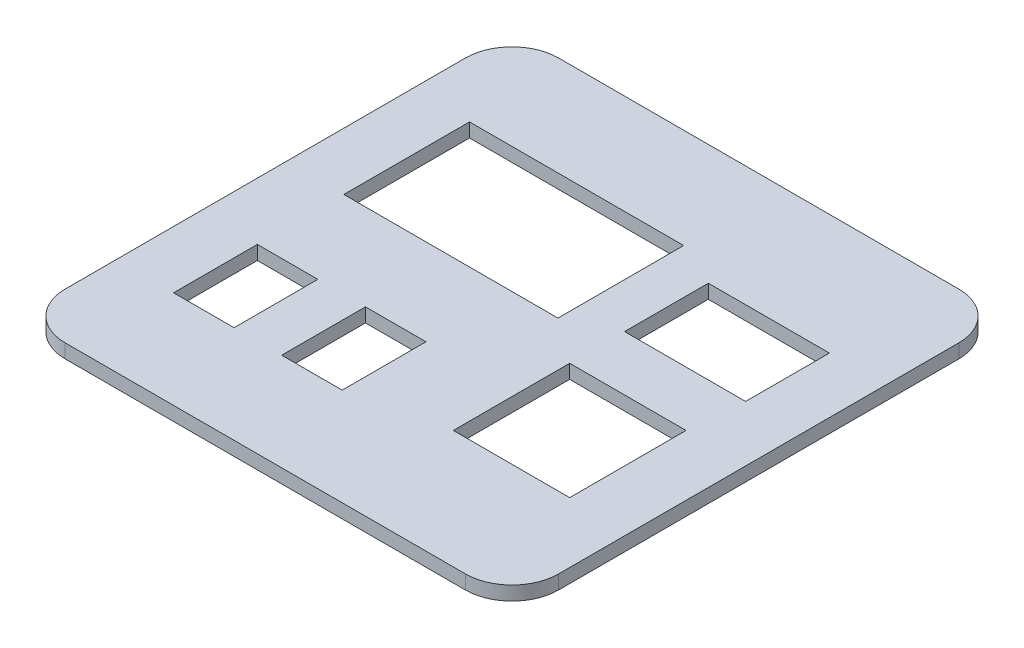
ISO-10303-21;
HEADER;
FILE_DESCRIPTION(('STEP AP214'),'2;1');
FILE_NAME('part.step','',(''),(''),'','','');
FILE_SCHEMA(('AUTOMOTIVE_DESIGN { 1 0 10303 214 1 1 1 1 }'));
ENDSEC;
DATA;
#1=APPLICATION_CONTEXT('core data for automotive mechanical design processes');
#2=APPLICATION_PROTOCOL_DEFINITION('international standard','automotive_design',2000,#1);
#3=PRODUCT_CONTEXT('',#1,'mechanical');
#4=PRODUCT('Part','Part','',(#3));
#5=PRODUCT_RELATED_PRODUCT_CATEGORY('part','',(#4));
#6=PRODUCT_DEFINITION_FORMATION('','',#4);
#7=PRODUCT_DEFINITION_CONTEXT('part definition',#1,'design');
#8=PRODUCT_DEFINITION('design','',#6,#7);
#9=PRODUCT_DEFINITION_SHAPE('','',#8);
#10=(LENGTH_UNIT() NAMED_UNIT(*) SI_UNIT(.MILLI.,.METRE.));
#11=(NAMED_UNIT(*) PLANE_ANGLE_UNIT() SI_UNIT($,.RADIAN.));
#12=(NAMED_UNIT(*) SI_UNIT($,.STERADIAN.) SOLID_ANGLE_UNIT());
#13=UNCERTAINTY_MEASURE_WITH_UNIT(LENGTH_MEASURE(1.E-05),#10,'distance_accuracy_value','');
#14=(GEOMETRIC_REPRESENTATION_CONTEXT(3) GLOBAL_UNCERTAINTY_ASSIGNED_CONTEXT((#13)) GLOBAL_UNIT_ASSIGNED_CONTEXT((#10,
#11,#12)) REPRESENTATION_CONTEXT('',''));
#15=CARTESIAN_POINT('',(0.,0.,0.));
#16=DIRECTION('',(0.,0.,1.));
#17=DIRECTION('',(1.,0.,0.));
#18=AXIS2_PLACEMENT_3D('',#15,#16,#17);
#19=CARTESIAN_POINT('',(43.,3.,-43.));
#20=DIRECTION('',(0.,-1.,0.));
#21=DIRECTION('',(0.,0.,-1.));
#22=AXIS2_PLACEMENT_3D('',#19,#20,#21);
#23=CYLINDRICAL_SURFACE('',#22,10.);
#24=CARTESIAN_POINT('',(43.,0.,-43.));
#25=DIRECTION('',(0.,1.,0.));
#26=DIRECTION('',(0.,0.,1.));
#27=AXIS2_PLACEMENT_3D('',#24,#25,#26);
#28=CIRCLE('',#27,10.);
#29=CARTESIAN_POINT('',(42.9999999999999,0.,-53.));
#30=VERTEX_POINT('',#29);
#31=CARTESIAN_POINT('',(53.,0.,-42.9999999999999));
#32=VERTEX_POINT('',#31);
#33=EDGE_CURVE('E431',#30,#32,#28,.F.);
#34=ORIENTED_EDGE('',*,*,#33,.F.);
#35=DIRECTION('',(0.,-1.,0.));
#36=VECTOR('',#35,1.);
#37=CARTESIAN_POINT('',(42.9999999999999,3.,-53.));
#38=LINE('',#37,#36);
#39=CARTESIAN_POINT('',(42.9999999999999,3.,-53.));
#40=VERTEX_POINT('',#39);
#41=EDGE_CURVE('E11',#40,#30,#38,.T.);
#42=ORIENTED_EDGE('',*,*,#41,.F.);
#43=CARTESIAN_POINT('',(43.,3.,-43.));
#44=DIRECTION('',(0.,1.,0.));
#45=DIRECTION('',(0.,0.,1.));
#46=AXIS2_PLACEMENT_3D('',#43,#44,#45);
#47=CIRCLE('',#46,10.);
#48=CARTESIAN_POINT('',(53.,3.,-42.9999999999999));
#49=VERTEX_POINT('',#48);
#50=EDGE_CURVE('E525',#40,#49,#47,.F.);
#51=ORIENTED_EDGE('',*,*,#50,.T.);
#52=DIRECTION('',(0.,-1.,0.));
#53=VECTOR('',#52,1.);
#54=CARTESIAN_POINT('',(53.,3.,-42.9999999999999));
#55=LINE('',#54,#53);
#56=EDGE_CURVE('E153',#49,#32,#55,.T.);
#57=ORIENTED_EDGE('',*,*,#56,.T.);
#58=EDGE_LOOP('',(#34,#42,#51,#57));
#59=FACE_BOUND('',#58,.T.);
#60=ADVANCED_FACE('F39',(#59),#23,.T.);
#61=CARTESIAN_POINT('',(0.,3.,-53.));
#62=DIRECTION('',(0.,0.,-1.));
#63=DIRECTION('',(-1.,0.,0.));
#64=AXIS2_PLACEMENT_3D('',#61,#62,#63);
#65=PLANE('',#64);
#66=DIRECTION('',(1.,0.,0.));
#67=VECTOR('',#66,1.);
#68=CARTESIAN_POINT('',(0.,0.,-53.));
#69=LINE('',#68,#67);
#70=CARTESIAN_POINT('',(-42.9999999999999,0.,-53.));
#71=VERTEX_POINT('',#70);
#72=EDGE_CURVE('E434',#71,#30,#69,.T.);
#73=ORIENTED_EDGE('',*,*,#72,.F.);
#74=DIRECTION('',(0.,-1.,0.));
#75=VECTOR('',#74,1.);
#76=CARTESIAN_POINT('',(-42.9999999999999,3.,-53.));
#77=LINE('',#76,#75);
#78=CARTESIAN_POINT('',(-42.9999999999999,3.,-53.));
#79=VERTEX_POINT('',#78);
#80=EDGE_CURVE('E50',#79,#71,#77,.T.);
#81=ORIENTED_EDGE('',*,*,#80,.F.);
#82=DIRECTION('',(1.,0.,0.));
#83=VECTOR('',#82,1.);
#84=CARTESIAN_POINT('',(0.,3.,-53.));
#85=LINE('',#84,#83);
#86=EDGE_CURVE('E528',#79,#40,#85,.T.);
#87=ORIENTED_EDGE('',*,*,#86,.T.);
#88=ORIENTED_EDGE('',*,*,#41,.T.);
#89=EDGE_LOOP('',(#73,#81,#87,#88));
#90=FACE_BOUND('',#89,.T.);
#91=ADVANCED_FACE('F555',(#90),#65,.T.);
#92=CARTESIAN_POINT('',(-43.,3.,-43.));
#93=DIRECTION('',(0.,-1.,0.));
#94=DIRECTION('',(0.,0.,-1.));
#95=AXIS2_PLACEMENT_3D('',#92,#93,#94);
#96=CYLINDRICAL_SURFACE('',#95,10.);
#97=CARTESIAN_POINT('',(-43.,0.,-43.));
#98=DIRECTION('',(0.,1.,0.));
#99=DIRECTION('',(0.,0.,1.));
#100=AXIS2_PLACEMENT_3D('',#97,#98,#99);
#101=CIRCLE('',#100,10.);
#102=CARTESIAN_POINT('',(-53.,0.,-42.9999999999999));
#103=VERTEX_POINT('',#102);
#104=EDGE_CURVE('E438',#103,#71,#101,.F.);
#105=ORIENTED_EDGE('',*,*,#104,.F.);
#106=DIRECTION('',(0.,-1.,0.));
#107=VECTOR('',#106,1.);
#108=CARTESIAN_POINT('',(-53.,3.,-42.9999999999999));
#109=LINE('',#108,#107);
#110=CARTESIAN_POINT('',(-53.,3.,-42.9999999999999));
#111=VERTEX_POINT('',#110);
#112=EDGE_CURVE('E271',#111,#103,#109,.T.);
#113=ORIENTED_EDGE('',*,*,#112,.F.);
#114=CARTESIAN_POINT('',(-43.,3.,-43.));
#115=DIRECTION('',(0.,1.,0.));
#116=DIRECTION('',(0.,0.,1.));
#117=AXIS2_PLACEMENT_3D('',#114,#115,#116);
#118=CIRCLE('',#117,10.);
#119=EDGE_CURVE('E532',#111,#79,#118,.F.);
#120=ORIENTED_EDGE('',*,*,#119,.T.);
#121=ORIENTED_EDGE('',*,*,#80,.T.);
#122=EDGE_LOOP('',(#105,#113,#120,#121));
#123=FACE_BOUND('',#122,.T.);
#124=ADVANCED_FACE('F551',(#123),#96,.T.);
#125=CARTESIAN_POINT('',(-53.,3.,0.));
#126=DIRECTION('',(-1.,0.,0.));
#127=DIRECTION('',(0.,0.,1.));
#128=AXIS2_PLACEMENT_3D('',#125,#126,#127);
#129=PLANE('',#128);
#130=DIRECTION('',(0.,0.,-1.));
#131=VECTOR('',#130,1.);
#132=CARTESIAN_POINT('',(-53.,0.,0.));
#133=LINE('',#132,#131);
#134=CARTESIAN_POINT('',(-53.,0.,42.9999999999999));
#135=VERTEX_POINT('',#134);
#136=EDGE_CURVE('E442',#135,#103,#133,.T.);
#137=ORIENTED_EDGE('',*,*,#136,.F.);
#138=DIRECTION('',(0.,-1.,0.));
#139=VECTOR('',#138,1.);
#140=CARTESIAN_POINT('',(-53.,3.,42.9999999999999));
#141=LINE('',#140,#139);
#142=CARTESIAN_POINT('',(-53.,3.,42.9999999999999));
#143=VERTEX_POINT('',#142);
#144=EDGE_CURVE('E264',#143,#135,#141,.T.);
#145=ORIENTED_EDGE('',*,*,#144,.F.);
#146=DIRECTION('',(0.,0.,-1.));
#147=VECTOR('',#146,1.);
#148=CARTESIAN_POINT('',(-53.,3.,0.));
#149=LINE('',#148,#147);
#150=EDGE_CURVE('E536',#143,#111,#149,.T.);
#151=ORIENTED_EDGE('',*,*,#150,.T.);
#152=ORIENTED_EDGE('',*,*,#112,.T.);
#153=EDGE_LOOP('',(#137,#145,#151,#152));
#154=FACE_BOUND('',#153,.T.);
#155=ADVANCED_FACE('F548',(#154),#129,.T.);
#156=CARTESIAN_POINT('',(-43.,3.,43.));
#157=DIRECTION('',(0.,-1.,0.));
#158=DIRECTION('',(0.,0.,-1.));
#159=AXIS2_PLACEMENT_3D('',#156,#157,#158);
#160=CYLINDRICAL_SURFACE('',#159,10.);
#161=CARTESIAN_POINT('',(-43.,0.,43.));
#162=DIRECTION('',(0.,1.,0.));
#163=DIRECTION('',(0.,0.,1.));
#164=AXIS2_PLACEMENT_3D('',#161,#162,#163);
#165=CIRCLE('',#164,10.);
#166=CARTESIAN_POINT('',(-42.9999999999999,0.,53.));
#167=VERTEX_POINT('',#166);
#168=EDGE_CURVE('E446',#167,#135,#165,.F.);
#169=ORIENTED_EDGE('',*,*,#168,.F.);
#170=DIRECTION('',(0.,-1.,0.));
#171=VECTOR('',#170,1.);
#172=CARTESIAN_POINT('',(-42.9999999999999,3.,53.));
#173=LINE('',#172,#171);
#174=CARTESIAN_POINT('',(-42.9999999999999,3.,53.));
#175=VERTEX_POINT('',#174);
#176=EDGE_CURVE('E260',#175,#167,#173,.T.);
#177=ORIENTED_EDGE('',*,*,#176,.F.);
#178=CARTESIAN_POINT('',(-43.,3.,43.));
#179=DIRECTION('',(0.,1.,0.));
#180=DIRECTION('',(0.,0.,1.));
#181=AXIS2_PLACEMENT_3D('',#178,#179,#180);
#182=CIRCLE('',#181,10.);
#183=EDGE_CURVE('E252',#175,#143,#182,.F.);
#184=ORIENTED_EDGE('',*,*,#183,.T.);
#185=ORIENTED_EDGE('',*,*,#144,.T.);
#186=EDGE_LOOP('',(#169,#177,#184,#185));
#187=FACE_BOUND('',#186,.T.);
#188=ADVANCED_FACE('F544',(#187),#160,.T.);
#189=CARTESIAN_POINT('',(0.,3.,53.));
#190=DIRECTION('',(0.,0.,-1.));
#191=DIRECTION('',(-1.,0.,0.));
#192=AXIS2_PLACEMENT_3D('',#189,#190,#191);
#193=PLANE('',#192);
#194=DIRECTION('',(1.,0.,0.));
#195=VECTOR('',#194,1.);
#196=CARTESIAN_POINT('',(0.,0.,53.));
#197=LINE('',#196,#195);
#198=CARTESIAN_POINT('',(42.9999999999999,0.,53.));
#199=VERTEX_POINT('',#198);
#200=EDGE_CURVE('E258',#167,#199,#197,.T.);
#201=ORIENTED_EDGE('',*,*,#200,.T.);
#202=DIRECTION('',(0.,-1.,0.));
#203=VECTOR('',#202,1.);
#204=CARTESIAN_POINT('',(42.9999999999999,3.,53.));
#205=LINE('',#204,#203);
#206=CARTESIAN_POINT('',(42.9999999999999,3.,53.));
#207=VERTEX_POINT('',#206);
#208=EDGE_CURVE('E241',#207,#199,#205,.T.);
#209=ORIENTED_EDGE('',*,*,#208,.F.);
#210=DIRECTION('',(1.,0.,0.));
#211=VECTOR('',#210,1.);
#212=CARTESIAN_POINT('',(0.,3.,53.));
#213=LINE('',#212,#211);
#214=EDGE_CURVE('E245',#175,#207,#213,.T.);
#215=ORIENTED_EDGE('',*,*,#214,.F.);
#216=ORIENTED_EDGE('',*,*,#176,.T.);
#217=EDGE_LOOP('',(#201,#209,#215,#216));
#218=FACE_BOUND('',#217,.T.);
#219=ADVANCED_FACE('F256',(#218),#193,.F.);
#220=CARTESIAN_POINT('',(43.,3.,43.));
#221=DIRECTION('',(0.,-1.,0.));
#222=DIRECTION('',(0.,0.,-1.));
#223=AXIS2_PLACEMENT_3D('',#220,#221,#222);
#224=CYLINDRICAL_SURFACE('',#223,10.);
#225=CARTESIAN_POINT('',(43.,0.,43.));
#226=DIRECTION('',(0.,1.,0.));
#227=DIRECTION('',(0.,0.,1.));
#228=AXIS2_PLACEMENT_3D('',#225,#226,#227);
#229=CIRCLE('',#228,10.);
#230=CARTESIAN_POINT('',(53.,0.,42.9999999999999));
#231=VERTEX_POINT('',#230);
#232=EDGE_CURVE('E452',#199,#231,#229,.T.);
#233=ORIENTED_EDGE('',*,*,#232,.T.);
#234=DIRECTION('',(0.,-1.,0.));
#235=VECTOR('',#234,1.);
#236=CARTESIAN_POINT('',(53.,3.,42.9999999999999));
#237=LINE('',#236,#235);
#238=CARTESIAN_POINT('',(53.,3.,42.9999999999999));
#239=VERTEX_POINT('',#238);
#240=EDGE_CURVE('E243',#239,#231,#237,.T.);
#241=ORIENTED_EDGE('',*,*,#240,.F.);
#242=CARTESIAN_POINT('',(43.,3.,43.));
#243=DIRECTION('',(0.,1.,0.));
#244=DIRECTION('',(0.,0.,1.));
#245=AXIS2_PLACEMENT_3D('',#242,#243,#244);
#246=CIRCLE('',#245,10.);
#247=EDGE_CURVE('E236',#207,#239,#246,.T.);
#248=ORIENTED_EDGE('',*,*,#247,.F.);
#249=ORIENTED_EDGE('',*,*,#208,.T.);
#250=EDGE_LOOP('',(#233,#241,#248,#249));
#251=FACE_BOUND('',#250,.T.);
#252=ADVANCED_FACE('F239',(#251),#224,.T.);
#253=CARTESIAN_POINT('',(0.,3.,32.0460052222565));
#254=DIRECTION('',(0.,0.,1.));
#255=DIRECTION('',(1.,0.,0.));
#256=AXIS2_PLACEMENT_3D('',#253,#254,#255);
#257=PLANE('',#256);
#258=DIRECTION('',(-1.,0.,0.));
#259=VECTOR('',#258,1.);
#260=CARTESIAN_POINT('',(0.,0.,32.0460052222565));
#261=LINE('',#260,#259);
#262=CARTESIAN_POINT('',(-4.43465126492436,0.,32.0460052222565));
#263=VERTEX_POINT('',#262);
#264=CARTESIAN_POINT('',(-17.4346512649244,0.,32.0460052222565));
#265=VERTEX_POINT('',#264);
#266=EDGE_CURVE('E418',#263,#265,#261,.T.);
#267=ORIENTED_EDGE('',*,*,#266,.T.);
#268=DIRECTION('',(0.,-1.,0.));
#269=VECTOR('',#268,1.);
#270=CARTESIAN_POINT('',(-17.4346512649244,3.,32.0460052222565));
#271=LINE('',#270,#269);
#272=CARTESIAN_POINT('',(-17.4346512649244,3.,32.0460052222565));
#273=VERTEX_POINT('',#272);
#274=EDGE_CURVE('E289',#273,#265,#271,.T.);
#275=ORIENTED_EDGE('',*,*,#274,.F.);
#276=DIRECTION('',(-1.,0.,0.));
#277=VECTOR('',#276,1.);
#278=CARTESIAN_POINT('',(0.,3.,32.0460052222565));
#279=LINE('',#278,#277);
#280=CARTESIAN_POINT('',(-4.43465126492436,3.,32.0460052222565));
#281=VERTEX_POINT('',#280);
#282=EDGE_CURVE('E512',#281,#273,#279,.T.);
#283=ORIENTED_EDGE('',*,*,#282,.F.);
#284=DIRECTION('',(0.,-1.,0.));
#285=VECTOR('',#284,1.);
#286=CARTESIAN_POINT('',(-4.43465126492436,3.,32.0460052222565));
#287=LINE('',#286,#285);
#288=EDGE_CURVE('E276',#281,#263,#287,.T.);
#289=ORIENTED_EDGE('',*,*,#288,.T.);
#290=EDGE_LOOP('',(#267,#275,#283,#289));
#291=FACE_BOUND('',#290,.T.);
#292=ADVANCED_FACE('F578',(#291),#257,.F.);
#293=CARTESIAN_POINT('',(-17.4346512649244,3.,0.));
#294=DIRECTION('',(-1.,0.,0.));
#295=DIRECTION('',(0.,0.,1.));
#296=AXIS2_PLACEMENT_3D('',#293,#294,#295);
#297=PLANE('',#296);
#298=DIRECTION('',(0.,0.,-1.));
#299=VECTOR('',#298,1.);
#300=CARTESIAN_POINT('',(-17.4346512649244,0.,0.));
#301=LINE('',#300,#299);
#302=CARTESIAN_POINT('',(-17.4346512649244,0.,14.0460052222564));
#303=VERTEX_POINT('',#302);
#304=EDGE_CURVE('E422',#265,#303,#301,.T.);
#305=ORIENTED_EDGE('',*,*,#304,.T.);
#306=DIRECTION('',(0.,-1.,0.));
#307=VECTOR('',#306,1.);
#308=CARTESIAN_POINT('',(-17.4346512649244,3.,14.0460052222564));
#309=LINE('',#308,#307);
#310=CARTESIAN_POINT('',(-17.4346512649244,3.,14.0460052222564));
#311=VERTEX_POINT('',#310);
#312=EDGE_CURVE('E285',#311,#303,#309,.T.);
#313=ORIENTED_EDGE('',*,*,#312,.F.);
#314=DIRECTION('',(0.,0.,-1.));
#315=VECTOR('',#314,1.);
#316=CARTESIAN_POINT('',(-17.4346512649244,3.,0.));
#317=LINE('',#316,#315);
#318=EDGE_CURVE('E516',#273,#311,#317,.T.);
#319=ORIENTED_EDGE('',*,*,#318,.F.);
#320=ORIENTED_EDGE('',*,*,#274,.T.);
#321=EDGE_LOOP('',(#305,#313,#319,#320));
#322=FACE_BOUND('',#321,.T.);
#323=ADVANCED_FACE('F574',(#322),#297,.F.);
#324=CARTESIAN_POINT('',(0.,3.,14.0460052222564));
#325=DIRECTION('',(0.,0.,-1.));
#326=DIRECTION('',(-1.,0.,0.));
#327=AXIS2_PLACEMENT_3D('',#324,#325,#326);
#328=PLANE('',#327);
#329=DIRECTION('',(1.,0.,0.));
#330=VECTOR('',#329,1.);
#331=CARTESIAN_POINT('',(0.,0.,14.0460052222564));
#332=LINE('',#331,#330);
#333=CARTESIAN_POINT('',(-4.43465126492436,0.,14.0460052222564));
#334=VERTEX_POINT('',#333);
#335=EDGE_CURVE('E425',#303,#334,#332,.T.);
#336=ORIENTED_EDGE('',*,*,#335,.T.);
#337=DIRECTION('',(0.,-1.,0.));
#338=VECTOR('',#337,1.);
#339=CARTESIAN_POINT('',(-4.43465126492436,3.,14.0460052222564));
#340=LINE('',#339,#338);
#341=CARTESIAN_POINT('',(-4.43465126492436,3.,14.0460052222564));
#342=VERTEX_POINT('',#341);
#343=EDGE_CURVE('E280',#342,#334,#340,.T.);
#344=ORIENTED_EDGE('',*,*,#343,.F.);
#345=DIRECTION('',(1.,0.,0.));
#346=VECTOR('',#345,1.);
#347=CARTESIAN_POINT('',(0.,3.,14.0460052222564));
#348=LINE('',#347,#346);
#349=EDGE_CURVE('E519',#311,#342,#348,.T.);
#350=ORIENTED_EDGE('',*,*,#349,.F.);
#351=ORIENTED_EDGE('',*,*,#312,.T.);
#352=EDGE_LOOP('',(#336,#344,#350,#351));
#353=FACE_BOUND('',#352,.T.);
#354=ADVANCED_FACE('F570',(#353),#328,.F.);
#355=CARTESIAN_POINT('',(0.,3.,32.0460052222565));
#356=DIRECTION('',(0.,0.,1.));
#357=DIRECTION('',(1.,0.,0.));
#358=AXIS2_PLACEMENT_3D('',#355,#356,#357);
#359=PLANE('',#358);
#360=DIRECTION('',(-1.,0.,0.));
#361=VECTOR('',#360,1.);
#362=CARTESIAN_POINT('',(0.,0.,32.0460052222565));
#363=LINE('',#362,#361);
#364=CARTESIAN_POINT('',(-27.6657657583487,0.,32.0460052222565));
#365=VERTEX_POINT('',#364);
#366=CARTESIAN_POINT('',(-40.6657657583487,0.,32.0460052222565));
#367=VERTEX_POINT('',#366);
#368=EDGE_CURVE('E405',#365,#367,#363,.T.);
#369=ORIENTED_EDGE('',*,*,#368,.T.);
#370=DIRECTION('',(0.,-1.,0.));
#371=VECTOR('',#370,1.);
#372=CARTESIAN_POINT('',(-40.6657657583487,3.,32.0460052222565));
#373=LINE('',#372,#371);
#374=CARTESIAN_POINT('',(-40.6657657583487,3.,32.0460052222565));
#375=VERTEX_POINT('',#374);
#376=EDGE_CURVE('E281',#375,#367,#373,.T.);
#377=ORIENTED_EDGE('',*,*,#376,.F.);
#378=DIRECTION('',(-1.,0.,0.));
#379=VECTOR('',#378,1.);
#380=CARTESIAN_POINT('',(0.,3.,32.0460052222565));
#381=LINE('',#380,#379);
#382=CARTESIAN_POINT('',(-27.6657657583487,3.,32.0460052222565));
#383=VERTEX_POINT('',#382);
#384=EDGE_CURVE('E499',#383,#375,#381,.T.);
#385=ORIENTED_EDGE('',*,*,#384,.F.);
#386=DIRECTION('',(0.,-1.,0.));
#387=VECTOR('',#386,1.);
#388=CARTESIAN_POINT('',(-27.6657657583487,3.,32.0460052222565));
#389=LINE('',#388,#387);
#390=EDGE_CURVE('E293',#383,#365,#389,.T.);
#391=ORIENTED_EDGE('',*,*,#390,.T.);
#392=EDGE_LOOP('',(#369,#377,#385,#391));
#393=FACE_BOUND('',#392,.T.);
#394=ADVANCED_FACE('F573',(#393),#359,.F.);
#395=CARTESIAN_POINT('',(-40.6657657583487,3.,0.));
#396=DIRECTION('',(-1.,0.,0.));
#397=DIRECTION('',(0.,0.,1.));
#398=AXIS2_PLACEMENT_3D('',#395,#396,#397);
#399=PLANE('',#398);
#400=DIRECTION('',(0.,0.,-1.));
#401=VECTOR('',#400,1.);
#402=CARTESIAN_POINT('',(-40.6657657583487,0.,0.));
#403=LINE('',#402,#401);
#404=CARTESIAN_POINT('',(-40.6657657583487,0.,14.0460052222564));
#405=VERTEX_POINT('',#404);
#406=EDGE_CURVE('E409',#367,#405,#403,.T.);
#407=ORIENTED_EDGE('',*,*,#406,.T.);
#408=DIRECTION('',(0.,-1.,0.));
#409=VECTOR('',#408,1.);
#410=CARTESIAN_POINT('',(-40.6657657583487,3.,14.0460052222564));
#411=LINE('',#410,#409);
#412=CARTESIAN_POINT('',(-40.6657657583487,3.,14.0460052222564));
#413=VERTEX_POINT('',#412);
#414=EDGE_CURVE('E302',#413,#405,#411,.T.);
#415=ORIENTED_EDGE('',*,*,#414,.F.);
#416=DIRECTION('',(0.,0.,-1.));
#417=VECTOR('',#416,1.);
#418=CARTESIAN_POINT('',(-40.6657657583487,3.,0.));
#419=LINE('',#418,#417);
#420=EDGE_CURVE('E503',#375,#413,#419,.T.);
#421=ORIENTED_EDGE('',*,*,#420,.F.);
#422=ORIENTED_EDGE('',*,*,#376,.T.);
#423=EDGE_LOOP('',(#407,#415,#421,#422));
#424=FACE_BOUND('',#423,.T.);
#425=ADVANCED_FACE('F591',(#424),#399,.F.);
#426=CARTESIAN_POINT('',(0.,3.,14.0460052222564));
#427=DIRECTION('',(0.,0.,-1.));
#428=DIRECTION('',(-1.,0.,0.));
#429=AXIS2_PLACEMENT_3D('',#426,#427,#428);
#430=PLANE('',#429);
#431=DIRECTION('',(1.,0.,0.));
#432=VECTOR('',#431,1.);
#433=CARTESIAN_POINT('',(0.,0.,14.0460052222564));
#434=LINE('',#433,#432);
#435=CARTESIAN_POINT('',(-27.6657657583487,0.,14.0460052222564));
#436=VERTEX_POINT('',#435);
#437=EDGE_CURVE('E412',#405,#436,#434,.T.);
#438=ORIENTED_EDGE('',*,*,#437,.T.);
#439=DIRECTION('',(0.,-1.,0.));
#440=VECTOR('',#439,1.);
#441=CARTESIAN_POINT('',(-27.6657657583487,3.,14.0460052222564));
#442=LINE('',#441,#440);
#443=CARTESIAN_POINT('',(-27.6657657583487,3.,14.0460052222564));
#444=VERTEX_POINT('',#443);
#445=EDGE_CURVE('E297',#444,#436,#442,.T.);
#446=ORIENTED_EDGE('',*,*,#445,.F.);
#447=DIRECTION('',(1.,0.,0.));
#448=VECTOR('',#447,1.);
#449=CARTESIAN_POINT('',(0.,3.,14.0460052222564));
#450=LINE('',#449,#448);
#451=EDGE_CURVE('E506',#413,#444,#450,.T.);
#452=ORIENTED_EDGE('',*,*,#451,.F.);
#453=ORIENTED_EDGE('',*,*,#414,.T.);
#454=EDGE_LOOP('',(#438,#446,#452,#453));
#455=FACE_BOUND('',#454,.T.);
#456=ADVANCED_FACE('F587',(#455),#430,.F.);
#457=CARTESIAN_POINT('',(0.,3.,-4.53888637248298));
#458=DIRECTION('',(0.,0.,1.));
#459=DIRECTION('',(1.,0.,0.));
#460=AXIS2_PLACEMENT_3D('',#457,#458,#459);
#461=PLANE('',#460);
#462=DIRECTION('',(-1.,0.,0.));
#463=VECTOR('',#462,1.);
#464=CARTESIAN_POINT('',(0.,0.,-4.53888637248298));
#465=LINE('',#464,#463);
#466=CARTESIAN_POINT('',(5.33423424165131,0.,-4.53888637248298));
#467=VERTEX_POINT('',#466);
#468=CARTESIAN_POINT('',(-40.6657657583487,0.,-4.53888637248298));
#469=VERTEX_POINT('',#468);
#470=EDGE_CURVE('E392',#467,#469,#465,.T.);
#471=ORIENTED_EDGE('',*,*,#470,.T.);
#472=DIRECTION('',(0.,-1.,0.));
#473=VECTOR('',#472,1.);
#474=CARTESIAN_POINT('',(-40.6657657583487,3.,-4.53888637248298));
#475=LINE('',#474,#473);
#476=CARTESIAN_POINT('',(-40.6657657583487,3.,-4.53888637248298));
#477=VERTEX_POINT('',#476);
#478=EDGE_CURVE('E298',#477,#469,#475,.T.);
#479=ORIENTED_EDGE('',*,*,#478,.F.);
#480=DIRECTION('',(-1.,0.,0.));
#481=VECTOR('',#480,1.);
#482=CARTESIAN_POINT('',(0.,3.,-4.53888637248298));
#483=LINE('',#482,#481);
#484=CARTESIAN_POINT('',(5.33423424165131,3.,-4.53888637248298));
#485=VERTEX_POINT('',#484);
#486=EDGE_CURVE('E486',#485,#477,#483,.T.);
#487=ORIENTED_EDGE('',*,*,#486,.F.);
#488=DIRECTION('',(0.,-1.,0.));
#489=VECTOR('',#488,1.);
#490=CARTESIAN_POINT('',(5.33423424165131,3.,-4.53888637248298));
#491=LINE('',#490,#489);
#492=EDGE_CURVE('E309',#485,#467,#491,.T.);
#493=ORIENTED_EDGE('',*,*,#492,.T.);
#494=EDGE_LOOP('',(#471,#479,#487,#493));
#495=FACE_BOUND('',#494,.T.);
#496=ADVANCED_FACE('F590',(#495),#461,.F.);
#497=CARTESIAN_POINT('',(-40.6657657583487,3.,0.));
#498=DIRECTION('',(-1.,0.,0.));
#499=DIRECTION('',(0.,0.,1.));
#500=AXIS2_PLACEMENT_3D('',#497,#498,#499);
#501=PLANE('',#500);
#502=DIRECTION('',(0.,0.,-1.));
#503=VECTOR('',#502,1.);
#504=CARTESIAN_POINT('',(-40.6657657583487,0.,0.));
#505=LINE('',#504,#503);
#506=CARTESIAN_POINT('',(-40.6657657583487,0.,-31.5388863724829));
#507=VERTEX_POINT('',#506);
#508=EDGE_CURVE('E396',#469,#507,#505,.T.);
#509=ORIENTED_EDGE('',*,*,#508,.T.);
#510=DIRECTION('',(0.,-1.,0.));
#511=VECTOR('',#510,1.);
#512=CARTESIAN_POINT('',(-40.6657657583487,3.,-31.5388863724829));
#513=LINE('',#512,#511);
#514=CARTESIAN_POINT('',(-40.6657657583487,3.,-31.5388863724829));
#515=VERTEX_POINT('',#514);
#516=EDGE_CURVE('E318',#515,#507,#513,.T.);
#517=ORIENTED_EDGE('',*,*,#516,.F.);
#518=DIRECTION('',(0.,0.,-1.));
#519=VECTOR('',#518,1.);
#520=CARTESIAN_POINT('',(-40.6657657583487,3.,0.));
#521=LINE('',#520,#519);
#522=EDGE_CURVE('E490',#477,#515,#521,.T.);
#523=ORIENTED_EDGE('',*,*,#522,.F.);
#524=ORIENTED_EDGE('',*,*,#478,.T.);
#525=EDGE_LOOP('',(#509,#517,#523,#524));
#526=FACE_BOUND('',#525,.T.);
#527=ADVANCED_FACE('F607',(#526),#501,.F.);
#528=CARTESIAN_POINT('',(0.,3.,-31.538886372483));
#529=DIRECTION('',(0.,0.,-1.));
#530=DIRECTION('',(-1.,0.,0.));
#531=AXIS2_PLACEMENT_3D('',#528,#529,#530);
#532=PLANE('',#531);
#533=DIRECTION('',(1.,0.,0.));
#534=VECTOR('',#533,1.);
#535=CARTESIAN_POINT('',(0.,0.,-31.538886372483));
#536=LINE('',#535,#534);
#537=CARTESIAN_POINT('',(5.3342342416513,0.,-31.538886372483));
#538=VERTEX_POINT('',#537);
#539=EDGE_CURVE('E399',#507,#538,#536,.T.);
#540=ORIENTED_EDGE('',*,*,#539,.T.);
#541=DIRECTION('',(0.,-1.,0.));
#542=VECTOR('',#541,1.);
#543=CARTESIAN_POINT('',(5.3342342416513,3.,-31.538886372483));
#544=LINE('',#543,#542);
#545=CARTESIAN_POINT('',(5.3342342416513,3.,-31.538886372483));
#546=VERTEX_POINT('',#545);
#547=EDGE_CURVE('E313',#546,#538,#544,.T.);
#548=ORIENTED_EDGE('',*,*,#547,.F.);
#549=DIRECTION('',(1.,0.,0.));
#550=VECTOR('',#549,1.);
#551=CARTESIAN_POINT('',(0.,3.,-31.538886372483));
#552=LINE('',#551,#550);
#553=EDGE_CURVE('E493',#515,#546,#552,.T.);
#554=ORIENTED_EDGE('',*,*,#553,.F.);
#555=ORIENTED_EDGE('',*,*,#516,.T.);
#556=EDGE_LOOP('',(#540,#548,#554,#555));
#557=FACE_BOUND('',#556,.T.);
#558=ADVANCED_FACE('F603',(#557),#532,.F.);
#559=CARTESIAN_POINT('',(41.,3.,0.));
#560=DIRECTION('',(-1.,0.,0.));
#561=DIRECTION('',(0.,0.,1.));
#562=AXIS2_PLACEMENT_3D('',#559,#560,#561);
#563=PLANE('',#562);
#564=DIRECTION('',(0.,0.,-1.));
#565=VECTOR('',#564,1.);
#566=CARTESIAN_POINT('',(41.,0.,0.));
#567=LINE('',#566,#565);
#568=CARTESIAN_POINT('',(41.,0.,-9.18510927116784));
#569=VERTEX_POINT('',#568);
#570=CARTESIAN_POINT('',(41.,0.,-27.1851092711678));
#571=VERTEX_POINT('',#570);
#572=EDGE_CURVE('E376',#569,#571,#567,.T.);
#573=ORIENTED_EDGE('',*,*,#572,.F.);
#574=DIRECTION('',(0.,-1.,0.));
#575=VECTOR('',#574,1.);
#576=CARTESIAN_POINT('',(41.,3.,-9.18510927116784));
#577=LINE('',#576,#575);
#578=CARTESIAN_POINT('',(41.,3.,-9.18510927116784));
#579=VERTEX_POINT('',#578);
#580=EDGE_CURVE('E314',#579,#569,#577,.T.);
#581=ORIENTED_EDGE('',*,*,#580,.F.);
#582=DIRECTION('',(0.,0.,-1.));
#583=VECTOR('',#582,1.);
#584=CARTESIAN_POINT('',(41.,3.,0.));
#585=LINE('',#584,#583);
#586=CARTESIAN_POINT('',(41.,3.,-27.1851092711678));
#587=VERTEX_POINT('',#586);
#588=EDGE_CURVE('E470',#579,#587,#585,.T.);
#589=ORIENTED_EDGE('',*,*,#588,.T.);
#590=DIRECTION('',(0.,-1.,0.));
#591=VECTOR('',#590,1.);
#592=CARTESIAN_POINT('',(41.,3.,-27.1851092711678));
#593=LINE('',#592,#591);
#594=EDGE_CURVE('E325',#587,#571,#593,.T.);
#595=ORIENTED_EDGE('',*,*,#594,.T.);
#596=EDGE_LOOP('',(#573,#581,#589,#595));
#597=FACE_BOUND('',#596,.T.);
#598=ADVANCED_FACE('F606',(#597),#563,.T.);
#599=CARTESIAN_POINT('',(0.,3.,-9.18510927116784));
#600=DIRECTION('',(0.,0.,-1.));
#601=DIRECTION('',(-1.,0.,0.));
#602=AXIS2_PLACEMENT_3D('',#599,#600,#601);
#603=PLANE('',#602);
#604=DIRECTION('',(1.,0.,0.));
#605=VECTOR('',#604,1.);
#606=CARTESIAN_POINT('',(0.,0.,-9.18510927116784));
#607=LINE('',#606,#605);
#608=CARTESIAN_POINT('',(15.,0.,-9.18510927116784));
#609=VERTEX_POINT('',#608);
#610=EDGE_CURVE('E380',#609,#569,#607,.T.);
#611=ORIENTED_EDGE('',*,*,#610,.F.);
#612=DIRECTION('',(0.,-1.,0.));
#613=VECTOR('',#612,1.);
#614=CARTESIAN_POINT('',(15.,3.,-9.18510927116784));
#615=LINE('',#614,#613);
#616=CARTESIAN_POINT('',(15.,3.,-9.18510927116784));
#617=VERTEX_POINT('',#616);
#618=EDGE_CURVE('E331',#617,#609,#615,.T.);
#619=ORIENTED_EDGE('',*,*,#618,.F.);
#620=DIRECTION('',(1.,0.,0.));
#621=VECTOR('',#620,1.);
#622=CARTESIAN_POINT('',(0.,3.,-9.18510927116784));
#623=LINE('',#622,#621);
#624=EDGE_CURVE('E474',#617,#579,#623,.T.);
#625=ORIENTED_EDGE('',*,*,#624,.T.);
#626=ORIENTED_EDGE('',*,*,#580,.T.);
#627=EDGE_LOOP('',(#611,#619,#625,#626));
#628=FACE_BOUND('',#627,.T.);
#629=ADVANCED_FACE('F622',(#628),#603,.T.);
#630=CARTESIAN_POINT('',(15.,3.,0.));
#631=DIRECTION('',(1.,0.,0.));
#632=DIRECTION('',(0.,0.,-1.));
#633=AXIS2_PLACEMENT_3D('',#630,#631,#632);
#634=PLANE('',#633);
#635=DIRECTION('',(0.,0.,1.));
#636=VECTOR('',#635,1.);
#637=CARTESIAN_POINT('',(15.,0.,0.));
#638=LINE('',#637,#636);
#639=CARTESIAN_POINT('',(15.,0.,-27.1851092711678));
#640=VERTEX_POINT('',#639);
#641=EDGE_CURVE('E384',#640,#609,#638,.T.);
#642=ORIENTED_EDGE('',*,*,#641,.F.);
#643=DIRECTION('',(0.,-1.,0.));
#644=VECTOR('',#643,1.);
#645=CARTESIAN_POINT('',(15.,3.,-27.1851092711678));
#646=LINE('',#645,#644);
#647=CARTESIAN_POINT('',(15.,3.,-27.1851092711678));
#648=VERTEX_POINT('',#647);
#649=EDGE_CURVE('E328',#648,#640,#646,.T.);
#650=ORIENTED_EDGE('',*,*,#649,.F.);
#651=DIRECTION('',(0.,0.,1.));
#652=VECTOR('',#651,1.);
#653=CARTESIAN_POINT('',(15.,3.,0.));
#654=LINE('',#653,#652);
#655=EDGE_CURVE('E478',#648,#617,#654,.T.);
#656=ORIENTED_EDGE('',*,*,#655,.T.);
#657=ORIENTED_EDGE('',*,*,#618,.T.);
#658=EDGE_LOOP('',(#642,#650,#656,#657));
#659=FACE_BOUND('',#658,.T.);
#660=ADVANCED_FACE('F619',(#659),#634,.T.);
#661=CARTESIAN_POINT('',(40.,3.,0.));
#662=DIRECTION('',(-1.,0.,0.));
#663=DIRECTION('',(0.,0.,1.));
#664=AXIS2_PLACEMENT_3D('',#661,#662,#663);
#665=PLANE('',#664);
#666=DIRECTION('',(0.,0.,-1.));
#667=VECTOR('',#666,1.);
#668=CARTESIAN_POINT('',(40.,0.,0.));
#669=LINE('',#668,#667);
#670=CARTESIAN_POINT('',(40.,0.,27.6091488562629));
#671=VERTEX_POINT('',#670);
#672=CARTESIAN_POINT('',(40.,0.,2.60914885626296));
#673=VERTEX_POINT('',#672);
#674=EDGE_CURVE('E357',#671,#673,#669,.T.);
#675=ORIENTED_EDGE('',*,*,#674,.F.);
#676=DIRECTION('',(0.,-1.,0.));
#677=VECTOR('',#676,1.);
#678=CARTESIAN_POINT('',(40.,3.,27.6091488562629));
#679=LINE('',#678,#677);
#680=CARTESIAN_POINT('',(40.,3.,27.6091488562629));
#681=VERTEX_POINT('',#680);
#682=EDGE_CURVE('E43',#681,#671,#679,.T.);
#683=ORIENTED_EDGE('',*,*,#682,.F.);
#684=DIRECTION('',(0.,0.,-1.));
#685=VECTOR('',#684,1.);
#686=CARTESIAN_POINT('',(40.,3.,0.));
#687=LINE('',#686,#685);
#688=CARTESIAN_POINT('',(40.,3.,2.60914885626296));
#689=VERTEX_POINT('',#688);
#690=EDGE_CURVE('E456',#681,#689,#687,.T.);
#691=ORIENTED_EDGE('',*,*,#690,.T.);
#692=DIRECTION('',(0.,-1.,0.));
#693=VECTOR('',#692,1.);
#694=CARTESIAN_POINT('',(40.,3.,2.60914885626296));
#695=LINE('',#694,#693);
#696=EDGE_CURVE('E336',#689,#673,#695,.T.);
#697=ORIENTED_EDGE('',*,*,#696,.T.);
#698=EDGE_LOOP('',(#675,#683,#691,#697));
#699=FACE_BOUND('',#698,.T.);
#700=ADVANCED_FACE('F41',(#699),#665,.T.);
#701=CARTESIAN_POINT('',(0.,3.,27.6091488562629));
#702=DIRECTION('',(0.,0.,-1.));
#703=DIRECTION('',(-1.,0.,0.));
#704=AXIS2_PLACEMENT_3D('',#701,#702,#703);
#705=PLANE('',#704);
#706=DIRECTION('',(1.,0.,0.));
#707=VECTOR('',#706,1.);
#708=CARTESIAN_POINT('',(0.,0.,27.6091488562629));
#709=LINE('',#708,#707);
#710=CARTESIAN_POINT('',(15.,0.,27.6091488562629));
#711=VERTEX_POINT('',#710);
#712=EDGE_CURVE('E353',#711,#671,#709,.T.);
#713=ORIENTED_EDGE('',*,*,#712,.F.);
#714=DIRECTION('',(0.,-1.,0.));
#715=VECTOR('',#714,1.);
#716=CARTESIAN_POINT('',(15.,3.,27.6091488562629));
#717=LINE('',#716,#715);
#718=CARTESIAN_POINT('',(15.,3.,27.6091488562629));
#719=VERTEX_POINT('',#718);
#720=EDGE_CURVE('E342',#719,#711,#717,.T.);
#721=ORIENTED_EDGE('',*,*,#720,.F.);
#722=DIRECTION('',(1.,0.,0.));
#723=VECTOR('',#722,1.);
#724=CARTESIAN_POINT('',(0.,3.,27.6091488562629));
#725=LINE('',#724,#723);
#726=EDGE_CURVE('E355',#719,#681,#725,.T.);
#727=ORIENTED_EDGE('',*,*,#726,.T.);
#728=ORIENTED_EDGE('',*,*,#682,.T.);
#729=EDGE_LOOP('',(#713,#721,#727,#728));
#730=FACE_BOUND('',#729,.T.);
#731=ADVANCED_FACE('F351',(#730),#705,.T.);
#732=CARTESIAN_POINT('',(15.,3.,0.));
#733=DIRECTION('',(-1.,0.,0.));
#734=DIRECTION('',(0.,0.,1.));
#735=AXIS2_PLACEMENT_3D('',#732,#733,#734);
#736=PLANE('',#735);
#737=DIRECTION('',(0.,0.,-1.));
#738=VECTOR('',#737,1.);
#739=CARTESIAN_POINT('',(15.,0.,0.));
#740=LINE('',#739,#738);
#741=CARTESIAN_POINT('',(15.,0.,2.60914885626296));
#742=VERTEX_POINT('',#741);
#743=EDGE_CURVE('E366',#711,#742,#740,.T.);
#744=ORIENTED_EDGE('',*,*,#743,.T.);
#745=DIRECTION('',(0.,-1.,0.));
#746=VECTOR('',#745,1.);
#747=CARTESIAN_POINT('',(15.,3.,2.60914885626296));
#748=LINE('',#747,#746);
#749=CARTESIAN_POINT('',(15.,3.,2.60914885626296));
#750=VERTEX_POINT('',#749);
#751=EDGE_CURVE('E339',#750,#742,#748,.T.);
#752=ORIENTED_EDGE('',*,*,#751,.F.);
#753=DIRECTION('',(0.,0.,-1.));
#754=VECTOR('',#753,1.);
#755=CARTESIAN_POINT('',(15.,3.,0.));
#756=LINE('',#755,#754);
#757=EDGE_CURVE('E462',#719,#750,#756,.T.);
#758=ORIENTED_EDGE('',*,*,#757,.F.);
#759=ORIENTED_EDGE('',*,*,#720,.T.);
#760=EDGE_LOOP('',(#744,#752,#758,#759));
#761=FACE_BOUND('',#760,.T.);
#762=ADVANCED_FACE('F568',(#761),#736,.F.);
#763=CARTESIAN_POINT('',(-4.43465126492436,3.,0.));
#764=DIRECTION('',(1.,0.,0.));
#765=DIRECTION('',(0.,0.,-1.));
#766=AXIS2_PLACEMENT_3D('',#763,#764,#765);
#767=PLANE('',#766);
#768=DIRECTION('',(0.,0.,1.));
#769=VECTOR('',#768,1.);
#770=CARTESIAN_POINT('',(-4.43465126492436,0.,0.));
#771=LINE('',#770,#769);
#772=EDGE_CURVE('E428',#334,#263,#771,.T.);
#773=ORIENTED_EDGE('',*,*,#772,.T.);
#774=ORIENTED_EDGE('',*,*,#288,.F.);
#775=DIRECTION('',(0.,0.,1.));
#776=VECTOR('',#775,1.);
#777=CARTESIAN_POINT('',(-4.43465126492436,3.,0.));
#778=LINE('',#777,#776);
#779=EDGE_CURVE('E522',#342,#281,#778,.T.);
#780=ORIENTED_EDGE('',*,*,#779,.F.);
#781=ORIENTED_EDGE('',*,*,#343,.T.);
#782=EDGE_LOOP('',(#773,#774,#780,#781));
#783=FACE_BOUND('',#782,.T.);
#784=ADVANCED_FACE('F564',(#783),#767,.F.);
#785=CARTESIAN_POINT('',(-27.6657657583487,3.,0.));
#786=DIRECTION('',(1.,0.,0.));
#787=DIRECTION('',(0.,0.,-1.));
#788=AXIS2_PLACEMENT_3D('',#785,#786,#787);
#789=PLANE('',#788);
#790=DIRECTION('',(0.,0.,1.));
#791=VECTOR('',#790,1.);
#792=CARTESIAN_POINT('',(-27.6657657583487,0.,0.));
#793=LINE('',#792,#791);
#794=EDGE_CURVE('E415',#436,#365,#793,.T.);
#795=ORIENTED_EDGE('',*,*,#794,.T.);
#796=ORIENTED_EDGE('',*,*,#390,.F.);
#797=DIRECTION('',(0.,0.,1.));
#798=VECTOR('',#797,1.);
#799=CARTESIAN_POINT('',(-27.6657657583487,3.,0.));
#800=LINE('',#799,#798);
#801=EDGE_CURVE('E509',#444,#383,#800,.T.);
#802=ORIENTED_EDGE('',*,*,#801,.F.);
#803=ORIENTED_EDGE('',*,*,#445,.T.);
#804=EDGE_LOOP('',(#795,#796,#802,#803));
#805=FACE_BOUND('',#804,.T.);
#806=ADVANCED_FACE('F567',(#805),#789,.F.);
#807=CARTESIAN_POINT('',(5.33423424165131,3.,0.));
#808=DIRECTION('',(1.,0.,0.));
#809=DIRECTION('',(0.,0.,-1.));
#810=AXIS2_PLACEMENT_3D('',#807,#808,#809);
#811=PLANE('',#810);
#812=DIRECTION('',(0.,0.,1.));
#813=VECTOR('',#812,1.);
#814=CARTESIAN_POINT('',(5.33423424165131,0.,0.));
#815=LINE('',#814,#813);
#816=EDGE_CURVE('E402',#538,#467,#815,.T.);
#817=ORIENTED_EDGE('',*,*,#816,.T.);
#818=ORIENTED_EDGE('',*,*,#492,.F.);
#819=DIRECTION('',(0.,0.,1.));
#820=VECTOR('',#819,1.);
#821=CARTESIAN_POINT('',(5.33423424165131,3.,0.));
#822=LINE('',#821,#820);
#823=EDGE_CURVE('E496',#546,#485,#822,.T.);
#824=ORIENTED_EDGE('',*,*,#823,.F.);
#825=ORIENTED_EDGE('',*,*,#547,.T.);
#826=EDGE_LOOP('',(#817,#818,#824,#825));
#827=FACE_BOUND('',#826,.T.);
#828=ADVANCED_FACE('F585',(#827),#811,.F.);
#829=CARTESIAN_POINT('',(0.,3.,-27.1851092711678));
#830=DIRECTION('',(0.,0.,1.));
#831=DIRECTION('',(1.,0.,0.));
#832=AXIS2_PLACEMENT_3D('',#829,#830,#831);
#833=PLANE('',#832);
#834=DIRECTION('',(-1.,0.,0.));
#835=VECTOR('',#834,1.);
#836=CARTESIAN_POINT('',(0.,0.,-27.1851092711678));
#837=LINE('',#836,#835);
#838=EDGE_CURVE('E388',#571,#640,#837,.T.);
#839=ORIENTED_EDGE('',*,*,#838,.F.);
#840=ORIENTED_EDGE('',*,*,#594,.F.);
#841=DIRECTION('',(-1.,0.,0.));
#842=VECTOR('',#841,1.);
#843=CARTESIAN_POINT('',(0.,3.,-27.1851092711678));
#844=LINE('',#843,#842);
#845=EDGE_CURVE('E482',#587,#648,#844,.T.);
#846=ORIENTED_EDGE('',*,*,#845,.T.);
#847=ORIENTED_EDGE('',*,*,#649,.T.);
#848=EDGE_LOOP('',(#839,#840,#846,#847));
#849=FACE_BOUND('',#848,.T.);
#850=ADVANCED_FACE('F601',(#849),#833,.T.);
#851=CARTESIAN_POINT('',(0.,3.,2.60914885626296));
#852=DIRECTION('',(0.,0.,-1.));
#853=DIRECTION('',(-1.,0.,0.));
#854=AXIS2_PLACEMENT_3D('',#851,#852,#853);
#855=PLANE('',#854);
#856=DIRECTION('',(1.,0.,0.));
#857=VECTOR('',#856,1.);
#858=CARTESIAN_POINT('',(0.,0.,2.60914885626296));
#859=LINE('',#858,#857);
#860=EDGE_CURVE('E370',#742,#673,#859,.T.);
#861=ORIENTED_EDGE('',*,*,#860,.T.);
#862=ORIENTED_EDGE('',*,*,#696,.F.);
#863=DIRECTION('',(1.,0.,0.));
#864=VECTOR('',#863,1.);
#865=CARTESIAN_POINT('',(0.,3.,2.60914885626296));
#866=LINE('',#865,#864);
#867=EDGE_CURVE('E467',#750,#689,#866,.T.);
#868=ORIENTED_EDGE('',*,*,#867,.F.);
#869=ORIENTED_EDGE('',*,*,#751,.T.);
#870=EDGE_LOOP('',(#861,#862,#868,#869));
#871=FACE_BOUND('',#870,.T.);
#872=ADVANCED_FACE('F617',(#871),#855,.F.);
#873=CARTESIAN_POINT('',(53.,3.,0.));
#874=DIRECTION('',(-1.,0.,0.));
#875=DIRECTION('',(0.,0.,1.));
#876=AXIS2_PLACEMENT_3D('',#873,#874,#875);
#877=PLANE('',#876);
#878=DIRECTION('',(0.,0.,-1.));
#879=VECTOR('',#878,1.);
#880=CARTESIAN_POINT('',(53.,0.,0.));
#881=LINE('',#880,#879);
#882=EDGE_CURVE('E146',#231,#32,#881,.T.);
#883=ORIENTED_EDGE('',*,*,#882,.T.);
#884=ORIENTED_EDGE('',*,*,#56,.F.);
#885=DIRECTION('',(0.,0.,-1.));
#886=VECTOR('',#885,1.);
#887=CARTESIAN_POINT('',(53.,3.,0.));
#888=LINE('',#887,#886);
#889=EDGE_CURVE('E59',#239,#49,#888,.T.);
#890=ORIENTED_EDGE('',*,*,#889,.F.);
#891=ORIENTED_EDGE('',*,*,#240,.T.);
#892=EDGE_LOOP('',(#883,#884,#890,#891));
#893=FACE_BOUND('',#892,.T.);
#894=ADVANCED_FACE('F632',(#893),#877,.F.);
#895=CARTESIAN_POINT('',(0.,3.,0.));
#896=DIRECTION('',(0.,1.,0.));
#897=DIRECTION('',(0.,0.,1.));
#898=AXIS2_PLACEMENT_3D('',#895,#896,#897);
#899=PLANE('',#898);
#900=ORIENTED_EDGE('',*,*,#690,.F.);
#901=ORIENTED_EDGE('',*,*,#726,.F.);
#902=ORIENTED_EDGE('',*,*,#757,.T.);
#903=ORIENTED_EDGE('',*,*,#867,.T.);
#904=EDGE_LOOP('',(#900,#901,#902,#903));
#905=FACE_BOUND('',#904,.T.);
#906=ORIENTED_EDGE('',*,*,#588,.F.);
#907=ORIENTED_EDGE('',*,*,#624,.F.);
#908=ORIENTED_EDGE('',*,*,#655,.F.);
#909=ORIENTED_EDGE('',*,*,#845,.F.);
#910=EDGE_LOOP('',(#906,#907,#908,#909));
#911=FACE_BOUND('',#910,.T.);
#912=ORIENTED_EDGE('',*,*,#486,.T.);
#913=ORIENTED_EDGE('',*,*,#522,.T.);
#914=ORIENTED_EDGE('',*,*,#553,.T.);
#915=ORIENTED_EDGE('',*,*,#823,.T.);
#916=EDGE_LOOP('',(#912,#913,#914,#915));
#917=FACE_BOUND('',#916,.T.);
#918=ORIENTED_EDGE('',*,*,#384,.T.);
#919=ORIENTED_EDGE('',*,*,#420,.T.);
#920=ORIENTED_EDGE('',*,*,#451,.T.);
#921=ORIENTED_EDGE('',*,*,#801,.T.);
#922=EDGE_LOOP('',(#918,#919,#920,#921));
#923=FACE_BOUND('',#922,.T.);
#924=ORIENTED_EDGE('',*,*,#282,.T.);
#925=ORIENTED_EDGE('',*,*,#318,.T.);
#926=ORIENTED_EDGE('',*,*,#349,.T.);
#927=ORIENTED_EDGE('',*,*,#779,.T.);
#928=EDGE_LOOP('',(#924,#925,#926,#927));
#929=FACE_BOUND('',#928,.T.);
#930=ORIENTED_EDGE('',*,*,#50,.F.);
#931=ORIENTED_EDGE('',*,*,#86,.F.);
#932=ORIENTED_EDGE('',*,*,#119,.F.);
#933=ORIENTED_EDGE('',*,*,#150,.F.);
#934=ORIENTED_EDGE('',*,*,#183,.F.);
#935=ORIENTED_EDGE('',*,*,#214,.T.);
#936=ORIENTED_EDGE('',*,*,#247,.T.);
#937=ORIENTED_EDGE('',*,*,#889,.T.);
#938=EDGE_LOOP('',(#930,#931,#932,#933,#934,#935,#936,#937));
#939=FACE_BOUND('',#938,.T.);
#940=ADVANCED_FACE('F249',(#905,#911,#917,#923,#929,#939),#899,.T.);
#941=CARTESIAN_POINT('',(0.,0.,0.));
#942=DIRECTION('',(0.,1.,0.));
#943=DIRECTION('',(0.,0.,1.));
#944=AXIS2_PLACEMENT_3D('',#941,#942,#943);
#945=PLANE('',#944);
#946=ORIENTED_EDGE('',*,*,#674,.T.);
#947=ORIENTED_EDGE('',*,*,#860,.F.);
#948=ORIENTED_EDGE('',*,*,#743,.F.);
#949=ORIENTED_EDGE('',*,*,#712,.T.);
#950=EDGE_LOOP('',(#946,#947,#948,#949));
#951=FACE_BOUND('',#950,.T.);
#952=ORIENTED_EDGE('',*,*,#572,.T.);
#953=ORIENTED_EDGE('',*,*,#838,.T.);
#954=ORIENTED_EDGE('',*,*,#641,.T.);
#955=ORIENTED_EDGE('',*,*,#610,.T.);
#956=EDGE_LOOP('',(#952,#953,#954,#955));
#957=FACE_BOUND('',#956,.T.);
#958=ORIENTED_EDGE('',*,*,#470,.F.);
#959=ORIENTED_EDGE('',*,*,#816,.F.);
#960=ORIENTED_EDGE('',*,*,#539,.F.);
#961=ORIENTED_EDGE('',*,*,#508,.F.);
#962=EDGE_LOOP('',(#958,#959,#960,#961));
#963=FACE_BOUND('',#962,.T.);
#964=ORIENTED_EDGE('',*,*,#368,.F.);
#965=ORIENTED_EDGE('',*,*,#794,.F.);
#966=ORIENTED_EDGE('',*,*,#437,.F.);
#967=ORIENTED_EDGE('',*,*,#406,.F.);
#968=EDGE_LOOP('',(#964,#965,#966,#967));
#969=FACE_BOUND('',#968,.T.);
#970=ORIENTED_EDGE('',*,*,#266,.F.);
#971=ORIENTED_EDGE('',*,*,#772,.F.);
#972=ORIENTED_EDGE('',*,*,#335,.F.);
#973=ORIENTED_EDGE('',*,*,#304,.F.);
#974=EDGE_LOOP('',(#970,#971,#972,#973));
#975=FACE_BOUND('',#974,.T.);
#976=ORIENTED_EDGE('',*,*,#33,.T.);
#977=ORIENTED_EDGE('',*,*,#882,.F.);
#978=ORIENTED_EDGE('',*,*,#232,.F.);
#979=ORIENTED_EDGE('',*,*,#200,.F.);
#980=ORIENTED_EDGE('',*,*,#168,.T.);
#981=ORIENTED_EDGE('',*,*,#136,.T.);
#982=ORIENTED_EDGE('',*,*,#104,.T.);
#983=ORIENTED_EDGE('',*,*,#72,.T.);
#984=EDGE_LOOP('',(#976,#977,#978,#979,#980,#981,#982,#983));
#985=FACE_BOUND('',#984,.T.);
#986=ADVANCED_FACE('F364',(#951,#957,#963,#969,#975,#985),#945,.F.);
#987=CLOSED_SHELL('',(#60,#91,#124,#155,#188,#219,#252,#292,#323,#354,#394,#425,#456,#496,#527,
#558,#598,#629,#660,#700,#731,#762,#784,#806,#828,#850,#872,#894,#940,#986));
#988=MANIFOLD_SOLID_BREP('B2',#987);
#989=ADVANCED_BREP_SHAPE_REPRESENTATION('',(#18,#988),#14);
#990=SHAPE_DEFINITION_REPRESENTATION(#9,#989);
ENDSEC;
END-ISO-10303-21;
